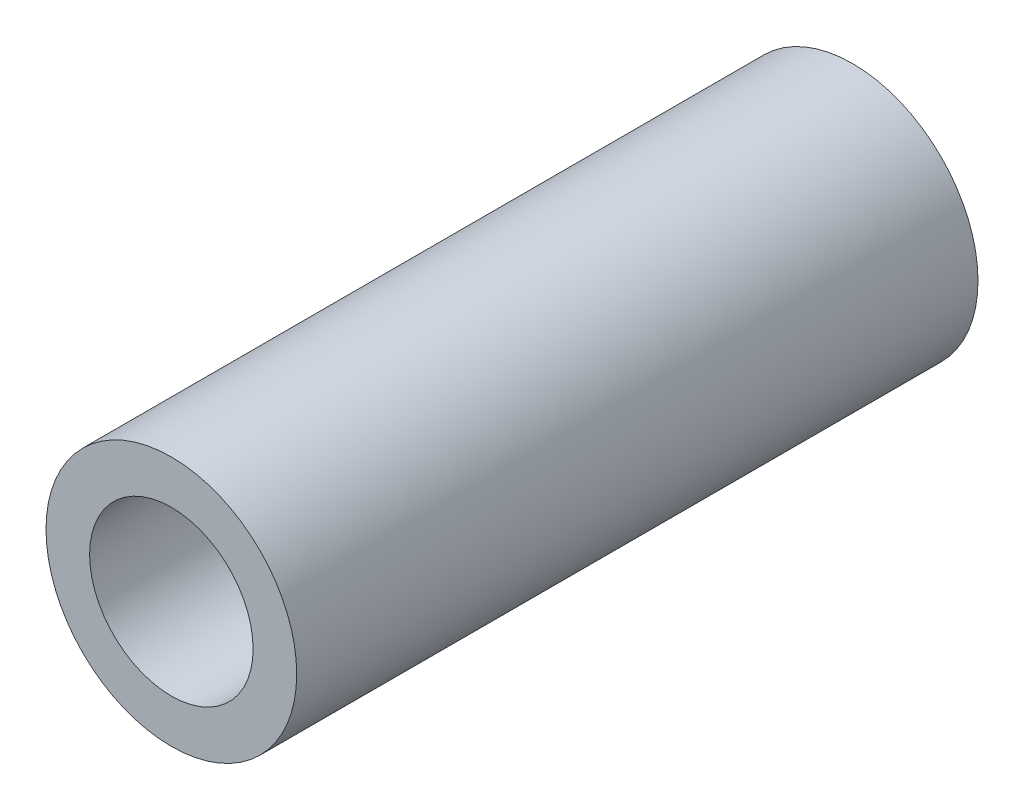
ISO-10303-21;
HEADER;
FILE_DESCRIPTION(('STEP AP214'),'2;1');
FILE_NAME('part.step','',(''),(''),'','','');
FILE_SCHEMA(('AUTOMOTIVE_DESIGN { 1 0 10303 214 1 1 1 1 }'));
ENDSEC;
DATA;
#1=APPLICATION_CONTEXT('core data for automotive mechanical design processes');
#2=APPLICATION_PROTOCOL_DEFINITION('international standard','automotive_design',2000,#1);
#3=PRODUCT_CONTEXT('',#1,'mechanical');
#4=PRODUCT('Part','Part','',(#3));
#5=PRODUCT_RELATED_PRODUCT_CATEGORY('part','',(#4));
#6=PRODUCT_DEFINITION_FORMATION('','',#4);
#7=PRODUCT_DEFINITION_CONTEXT('part definition',#1,'design');
#8=PRODUCT_DEFINITION('design','',#6,#7);
#9=PRODUCT_DEFINITION_SHAPE('','',#8);
#10=(LENGTH_UNIT() NAMED_UNIT(*) SI_UNIT(.MILLI.,.METRE.));
#11=(NAMED_UNIT(*) PLANE_ANGLE_UNIT() SI_UNIT($,.RADIAN.));
#12=(NAMED_UNIT(*) SI_UNIT($,.STERADIAN.) SOLID_ANGLE_UNIT());
#13=UNCERTAINTY_MEASURE_WITH_UNIT(LENGTH_MEASURE(1.E-05),#10,'distance_accuracy_value','');
#14=(GEOMETRIC_REPRESENTATION_CONTEXT(3) GLOBAL_UNCERTAINTY_ASSIGNED_CONTEXT((#13)) GLOBAL_UNIT_ASSIGNED_CONTEXT((#10,
#11,#12)) REPRESENTATION_CONTEXT('',''));
#15=CARTESIAN_POINT('',(0.,0.,0.));
#16=DIRECTION('',(0.,0.,1.));
#17=DIRECTION('',(1.,0.,0.));
#18=AXIS2_PLACEMENT_3D('',#15,#16,#17);
#19=CARTESIAN_POINT('',(0.,0.,-25.));
#20=DIRECTION('',(0.,0.,1.));
#21=DIRECTION('',(1.,0.,0.));
#22=AXIS2_PLACEMENT_3D('',#19,#20,#21);
#23=CYLINDRICAL_SURFACE('',#22,4.6);
#24=CARTESIAN_POINT('',(0.,0.,-25.));
#25=DIRECTION('',(0.,0.,1.));
#26=DIRECTION('',(1.,0.,0.));
#27=AXIS2_PLACEMENT_3D('',#24,#25,#26);
#28=CIRCLE('',#27,4.6);
#29=CARTESIAN_POINT('',(4.6,0.,-25.));
#30=VERTEX_POINT('',#29);
#31=EDGE_CURVE('E10',#30,#30,#28,.T.);
#32=ORIENTED_EDGE('',*,*,#31,.T.);
#33=EDGE_LOOP('',(#32));
#34=FACE_BOUND('',#33,.T.);
#35=CARTESIAN_POINT('',(0.,0.,0.));
#36=DIRECTION('',(0.,0.,1.));
#37=DIRECTION('',(1.,0.,0.));
#38=AXIS2_PLACEMENT_3D('',#35,#36,#37);
#39=CIRCLE('',#38,4.6);
#40=CARTESIAN_POINT('',(4.6,0.,0.));
#41=VERTEX_POINT('',#40);
#42=EDGE_CURVE('E34',#41,#41,#39,.T.);
#43=ORIENTED_EDGE('',*,*,#42,.F.);
#44=EDGE_LOOP('',(#43));
#45=FACE_BOUND('',#44,.T.);
#46=ADVANCED_FACE('F31',(#34,#45),#23,.T.);
#47=CARTESIAN_POINT('',(0.,0.,-25.));
#48=DIRECTION('',(0.,0.,1.));
#49=DIRECTION('',(1.,0.,0.));
#50=AXIS2_PLACEMENT_3D('',#47,#48,#49);
#51=PLANE('',#50);
#52=CARTESIAN_POINT('',(0.,0.,-25.));
#53=DIRECTION('',(0.,0.,1.));
#54=DIRECTION('',(1.,0.,0.));
#55=AXIS2_PLACEMENT_3D('',#52,#53,#54);
#56=CIRCLE('',#55,3.);
#57=CARTESIAN_POINT('',(3.,0.,-25.));
#58=VERTEX_POINT('',#57);
#59=EDGE_CURVE('E41',#58,#58,#56,.T.);
#60=ORIENTED_EDGE('',*,*,#59,.T.);
#61=EDGE_LOOP('',(#60));
#62=FACE_BOUND('',#61,.T.);
#63=ORIENTED_EDGE('',*,*,#31,.F.);
#64=EDGE_LOOP('',(#63));
#65=FACE_BOUND('',#64,.T.);
#66=ADVANCED_FACE('F49',(#62,#65),#51,.F.);
#67=CARTESIAN_POINT('',(0.,0.,0.));
#68=DIRECTION('',(0.,0.,1.));
#69=DIRECTION('',(1.,0.,0.));
#70=AXIS2_PLACEMENT_3D('',#67,#68,#69);
#71=PLANE('',#70);
#72=CARTESIAN_POINT('',(0.,0.,0.));
#73=DIRECTION('',(0.,0.,1.));
#74=DIRECTION('',(1.,0.,0.));
#75=AXIS2_PLACEMENT_3D('',#72,#73,#74);
#76=CIRCLE('',#75,3.);
#77=CARTESIAN_POINT('',(3.,0.,0.));
#78=VERTEX_POINT('',#77);
#79=EDGE_CURVE('E43',#78,#78,#76,.T.);
#80=ORIENTED_EDGE('',*,*,#79,.F.);
#81=EDGE_LOOP('',(#80));
#82=FACE_BOUND('',#81,.T.);
#83=ORIENTED_EDGE('',*,*,#42,.T.);
#84=EDGE_LOOP('',(#83));
#85=FACE_BOUND('',#84,.T.);
#86=ADVANCED_FACE('F55',(#82,#85),#71,.T.);
#87=CARTESIAN_POINT('',(0.,0.,-25.));
#88=DIRECTION('',(0.,0.,1.));
#89=DIRECTION('',(1.,0.,0.));
#90=AXIS2_PLACEMENT_3D('',#87,#88,#89);
#91=CYLINDRICAL_SURFACE('',#90,3.);
#92=ORIENTED_EDGE('',*,*,#59,.F.);
#93=EDGE_LOOP('',(#92));
#94=FACE_BOUND('',#93,.T.);
#95=ORIENTED_EDGE('',*,*,#79,.T.);
#96=EDGE_LOOP('',(#95));
#97=FACE_BOUND('',#96,.T.);
#98=ADVANCED_FACE('F52',(#94,#97),#91,.F.);
#99=CLOSED_SHELL('',(#46,#66,#86,#98));
#100=MANIFOLD_SOLID_BREP('B2',#99);
#101=ADVANCED_BREP_SHAPE_REPRESENTATION('',(#18,#100),#14);
#102=SHAPE_DEFINITION_REPRESENTATION(#9,#101);
ENDSEC;
END-ISO-10303-21;
